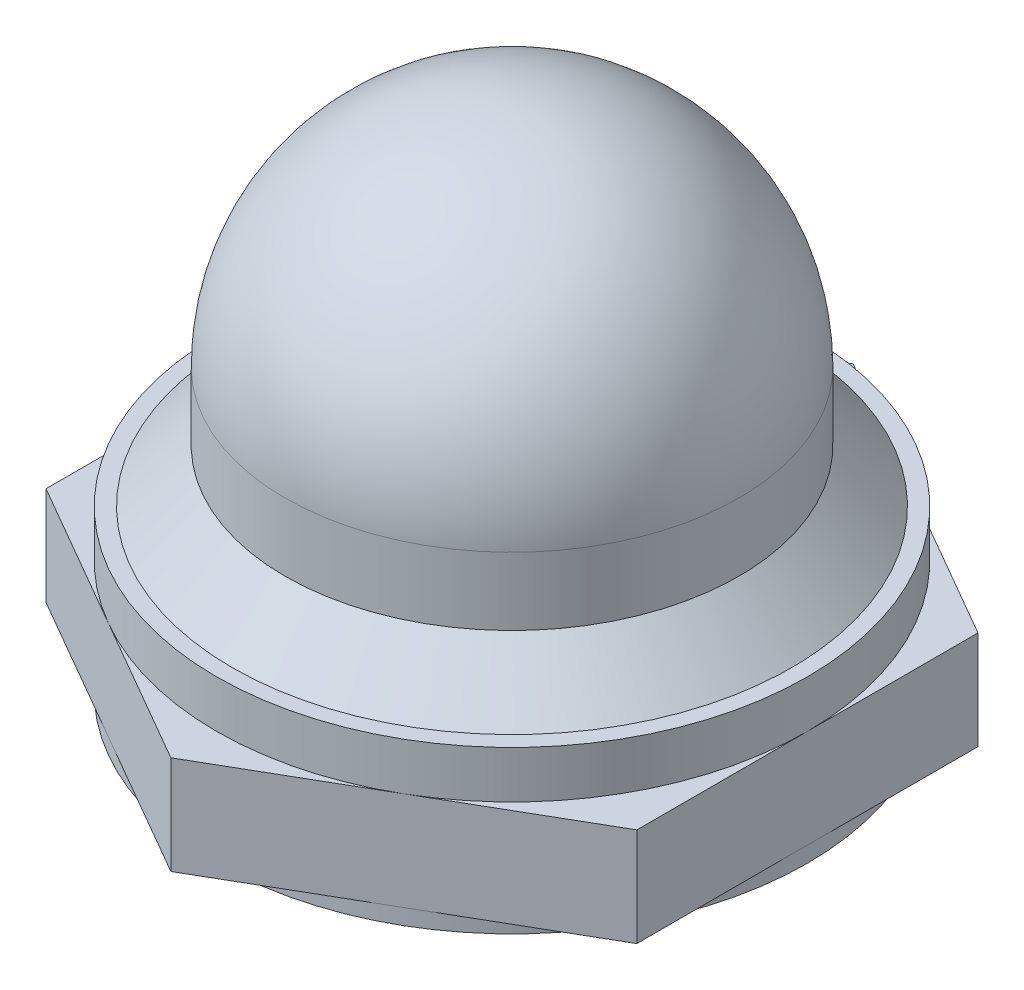
ISO-10303-21;
HEADER;
FILE_DESCRIPTION(('STEP AP214'),'2;1');
FILE_NAME('part.step','',(''),(''),'','','');
FILE_SCHEMA(('AUTOMOTIVE_DESIGN { 1 0 10303 214 1 1 1 1 }'));
ENDSEC;
DATA;
#1=APPLICATION_CONTEXT('core data for automotive mechanical design processes');
#2=APPLICATION_PROTOCOL_DEFINITION('international standard','automotive_design',2000,#1);
#3=PRODUCT_CONTEXT('',#1,'mechanical');
#4=PRODUCT('Part','Part','',(#3));
#5=PRODUCT_RELATED_PRODUCT_CATEGORY('part','',(#4));
#6=PRODUCT_DEFINITION_FORMATION('','',#4);
#7=PRODUCT_DEFINITION_CONTEXT('part definition',#1,'design');
#8=PRODUCT_DEFINITION('design','',#6,#7);
#9=PRODUCT_DEFINITION_SHAPE('','',#8);
#10=(LENGTH_UNIT() NAMED_UNIT(*) SI_UNIT(.MILLI.,.METRE.));
#11=(NAMED_UNIT(*) PLANE_ANGLE_UNIT() SI_UNIT($,.RADIAN.));
#12=(NAMED_UNIT(*) SI_UNIT($,.STERADIAN.) SOLID_ANGLE_UNIT());
#13=UNCERTAINTY_MEASURE_WITH_UNIT(LENGTH_MEASURE(1.E-05),#10,'distance_accuracy_value','');
#14=(GEOMETRIC_REPRESENTATION_CONTEXT(3) GLOBAL_UNCERTAINTY_ASSIGNED_CONTEXT((#13)) GLOBAL_UNIT_ASSIGNED_CONTEXT((#10,
#11,#12)) REPRESENTATION_CONTEXT('',''));
#15=CARTESIAN_POINT('',(0.,0.,0.));
#16=DIRECTION('',(0.,0.,1.));
#17=DIRECTION('',(1.,0.,0.));
#18=AXIS2_PLACEMENT_3D('',#15,#16,#17);
#19=CARTESIAN_POINT('',(0.,0.,0.));
#20=DIRECTION('',(0.,1.,0.));
#21=DIRECTION('',(0.,0.,1.));
#22=AXIS2_PLACEMENT_3D('',#19,#20,#21);
#23=PLANE('',#22);
#24=CARTESIAN_POINT('',(0.,0.,0.));
#25=DIRECTION('',(0.,-1.,0.));
#26=DIRECTION('',(0.,0.,-1.));
#27=AXIS2_PLACEMENT_3D('',#24,#25,#26);
#28=CIRCLE('',#27,4.7625);
#29=CARTESIAN_POINT('',(2.38125,0.,-4.12444598552339));
#30=VERTEX_POINT('',#29);
#31=CARTESIAN_POINT('',(4.7625,0.,0.));
#32=VERTEX_POINT('',#31);
#33=EDGE_CURVE('E59',#30,#32,#28,.T.);
#34=ORIENTED_EDGE('',*,*,#33,.F.);
#35=DIRECTION('',(-0.866025403784439,0.,-0.5));
#36=VECTOR('',#35,1.);
#37=CARTESIAN_POINT('',(4.7625,0.,-2.74963065701561));
#38=LINE('',#37,#36);
#39=CARTESIAN_POINT('',(4.7625,0.,-2.74963065701561));
#40=VERTEX_POINT('',#39);
#41=EDGE_CURVE('E143',#40,#30,#38,.T.);
#42=ORIENTED_EDGE('',*,*,#41,.F.);
#43=DIRECTION('',(0.,0.,-1.));
#44=VECTOR('',#43,1.);
#45=CARTESIAN_POINT('',(4.76250000000003,0.,2.74963065701561));
#46=LINE('',#45,#44);
#47=EDGE_CURVE('E160',#32,#40,#46,.T.);
#48=ORIENTED_EDGE('',*,*,#47,.F.);
#49=EDGE_LOOP('',(#34,#42,#48));
#50=FACE_BOUND('',#49,.T.);
#51=ADVANCED_FACE('F48',(#50),#23,.F.);
#52=CARTESIAN_POINT('',(2.38125,0.,4.12444598552336));
#53=VERTEX_POINT('',#52);
#54=EDGE_CURVE('E13',#32,#53,#28,.T.);
#55=ORIENTED_EDGE('',*,*,#54,.F.);
#56=CARTESIAN_POINT('',(4.76250000000003,0.,2.74963065701561));
#57=VERTEX_POINT('',#56);
#58=EDGE_CURVE('E158',#57,#32,#46,.T.);
#59=ORIENTED_EDGE('',*,*,#58,.F.);
#60=DIRECTION('',(0.866025403784439,0.,-0.5));
#61=VECTOR('',#60,1.);
#62=CARTESIAN_POINT('',(0.,0.,5.49926131403117));
#63=LINE('',#62,#61);
#64=EDGE_CURVE('E228',#53,#57,#63,.T.);
#65=ORIENTED_EDGE('',*,*,#64,.F.);
#66=EDGE_LOOP('',(#55,#59,#65));
#67=FACE_BOUND('',#66,.T.);
#68=ADVANCED_FACE('F294',(#67),#23,.F.);
#69=CARTESIAN_POINT('',(-2.38125,0.,4.12444598552336));
#70=VERTEX_POINT('',#69);
#71=EDGE_CURVE('E57',#53,#70,#28,.T.);
#72=ORIENTED_EDGE('',*,*,#71,.F.);
#73=CARTESIAN_POINT('',(0.,0.,5.49926131403117));
#74=VERTEX_POINT('',#73);
#75=EDGE_CURVE('E229',#74,#53,#63,.T.);
#76=ORIENTED_EDGE('',*,*,#75,.F.);
#77=DIRECTION('',(0.866025403784439,0.,0.5));
#78=VECTOR('',#77,1.);
#79=CARTESIAN_POINT('',(-4.76249999999995,0.,2.74963065701561));
#80=LINE('',#79,#78);
#81=EDGE_CURVE('E224',#70,#74,#80,.T.);
#82=ORIENTED_EDGE('',*,*,#81,.F.);
#83=EDGE_LOOP('',(#72,#76,#82));
#84=FACE_BOUND('',#83,.T.);
#85=ADVANCED_FACE('F278',(#84),#23,.F.);
#86=CARTESIAN_POINT('',(-4.76250000000002,0.,0.));
#87=VERTEX_POINT('',#86);
#88=EDGE_CURVE('E169',#70,#87,#28,.T.);
#89=ORIENTED_EDGE('',*,*,#88,.F.);
#90=CARTESIAN_POINT('',(-4.76249999999995,0.,2.74963065701561));
#91=VERTEX_POINT('',#90);
#92=EDGE_CURVE('E225',#91,#70,#80,.T.);
#93=ORIENTED_EDGE('',*,*,#92,.F.);
#94=DIRECTION('',(0.,0.,1.));
#95=VECTOR('',#94,1.);
#96=CARTESIAN_POINT('',(-4.7625,0.,-2.74963065701561));
#97=LINE('',#96,#95);
#98=EDGE_CURVE('E220',#87,#91,#97,.T.);
#99=ORIENTED_EDGE('',*,*,#98,.F.);
#100=EDGE_LOOP('',(#89,#93,#99));
#101=FACE_BOUND('',#100,.T.);
#102=ADVANCED_FACE('F274',(#101),#23,.F.);
#103=CARTESIAN_POINT('',(-2.38125,0.,-4.12444598552342));
#104=VERTEX_POINT('',#103);
#105=EDGE_CURVE('E73',#87,#104,#28,.T.);
#106=ORIENTED_EDGE('',*,*,#105,.F.);
#107=CARTESIAN_POINT('',(-4.7625,0.,-2.74963065701561));
#108=VERTEX_POINT('',#107);
#109=EDGE_CURVE('E221',#108,#87,#97,.T.);
#110=ORIENTED_EDGE('',*,*,#109,.F.);
#111=DIRECTION('',(-0.866025403784439,0.,0.5));
#112=VECTOR('',#111,1.);
#113=CARTESIAN_POINT('',(0.,0.,-5.49926131403117));
#114=LINE('',#113,#112);
#115=EDGE_CURVE('E153',#104,#108,#114,.T.);
#116=ORIENTED_EDGE('',*,*,#115,.F.);
#117=EDGE_LOOP('',(#106,#110,#116));
#118=FACE_BOUND('',#117,.T.);
#119=ADVANCED_FACE('F305',(#118),#23,.F.);
#120=CARTESIAN_POINT('',(0.,1.58749999999999,0.));
#121=DIRECTION('',(0.,1.,0.));
#122=DIRECTION('',(0.,0.,1.));
#123=AXIS2_PLACEMENT_3D('',#120,#121,#122);
#124=PLANE('',#123);
#125=DIRECTION('',(-0.866025403784439,0.,-0.5));
#126=VECTOR('',#125,1.);
#127=CARTESIAN_POINT('',(4.7625,1.58749999999999,-2.74963065701561));
#128=LINE('',#127,#126);
#129=CARTESIAN_POINT('',(4.7625,1.58749999999999,-2.74963065701561));
#130=VERTEX_POINT('',#129);
#131=CARTESIAN_POINT('',(2.38125,1.58749999999999,-4.12444598552339));
#132=VERTEX_POINT('',#131);
#133=EDGE_CURVE('E198',#130,#132,#128,.T.);
#134=ORIENTED_EDGE('',*,*,#133,.T.);
#135=CARTESIAN_POINT('',(0.,1.58749999999999,0.));
#136=DIRECTION('',(0.,-1.,0.));
#137=DIRECTION('',(0.,0.,-1.));
#138=AXIS2_PLACEMENT_3D('',#135,#136,#137);
#139=CIRCLE('',#138,4.7625);
#140=CARTESIAN_POINT('',(4.7625,1.58749999999999,0.));
#141=VERTEX_POINT('',#140);
#142=EDGE_CURVE('E173',#132,#141,#139,.T.);
#143=ORIENTED_EDGE('',*,*,#142,.T.);
#144=DIRECTION('',(0.,0.,-1.));
#145=VECTOR('',#144,1.);
#146=CARTESIAN_POINT('',(4.76250000000003,1.58749999999999,2.74963065701561));
#147=LINE('',#146,#145);
#148=EDGE_CURVE('E197',#141,#130,#147,.T.);
#149=ORIENTED_EDGE('',*,*,#148,.T.);
#150=EDGE_LOOP('',(#134,#143,#149));
#151=FACE_BOUND('',#150,.T.);
#152=ADVANCED_FACE('F290',(#151),#124,.T.);
#153=CARTESIAN_POINT('',(4.76250000000003,1.58749999999999,2.74963065701561));
#154=VERTEX_POINT('',#153);
#155=EDGE_CURVE('E193',#154,#141,#147,.T.);
#156=ORIENTED_EDGE('',*,*,#155,.T.);
#157=CARTESIAN_POINT('',(2.38125,1.58749999999999,4.12444598552336));
#158=VERTEX_POINT('',#157);
#159=EDGE_CURVE('E168',#141,#158,#139,.T.);
#160=ORIENTED_EDGE('',*,*,#159,.T.);
#161=DIRECTION('',(0.866025403784439,0.,-0.5));
#162=VECTOR('',#161,1.);
#163=CARTESIAN_POINT('',(0.,1.58749999999999,5.49926131403117));
#164=LINE('',#163,#162);
#165=EDGE_CURVE('E213',#158,#154,#164,.T.);
#166=ORIENTED_EDGE('',*,*,#165,.T.);
#167=EDGE_LOOP('',(#156,#160,#166));
#168=FACE_BOUND('',#167,.T.);
#169=ADVANCED_FACE('F286',(#168),#124,.T.);
#170=CARTESIAN_POINT('',(0.,1.58749999999999,5.49926131403117));
#171=VERTEX_POINT('',#170);
#172=EDGE_CURVE('E214',#171,#158,#164,.T.);
#173=ORIENTED_EDGE('',*,*,#172,.T.);
#174=CARTESIAN_POINT('',(-2.38125,1.58749999999999,4.12444598552336));
#175=VERTEX_POINT('',#174);
#176=EDGE_CURVE('E171',#158,#175,#139,.T.);
#177=ORIENTED_EDGE('',*,*,#176,.T.);
#178=DIRECTION('',(0.866025403784439,0.,0.5));
#179=VECTOR('',#178,1.);
#180=CARTESIAN_POINT('',(-4.76249999999995,1.58749999999999,2.74963065701561));
#181=LINE('',#180,#179);
#182=EDGE_CURVE('E209',#175,#171,#181,.T.);
#183=ORIENTED_EDGE('',*,*,#182,.T.);
#184=EDGE_LOOP('',(#173,#177,#183));
#185=FACE_BOUND('',#184,.T.);
#186=ADVANCED_FACE('F259',(#185),#124,.T.);
#187=CARTESIAN_POINT('',(-4.76249999999995,1.58749999999999,2.74963065701561));
#188=VERTEX_POINT('',#187);
#189=EDGE_CURVE('E210',#188,#175,#181,.T.);
#190=ORIENTED_EDGE('',*,*,#189,.T.);
#191=CARTESIAN_POINT('',(-4.76250000000002,1.58749999999999,0.));
#192=VERTEX_POINT('',#191);
#193=EDGE_CURVE('E250',#175,#192,#139,.T.);
#194=ORIENTED_EDGE('',*,*,#193,.T.);
#195=DIRECTION('',(0.,0.,1.));
#196=VECTOR('',#195,1.);
#197=CARTESIAN_POINT('',(-4.7625,1.58749999999999,-2.74963065701561));
#198=LINE('',#197,#196);
#199=EDGE_CURVE('E205',#192,#188,#198,.T.);
#200=ORIENTED_EDGE('',*,*,#199,.T.);
#201=EDGE_LOOP('',(#190,#194,#200));
#202=FACE_BOUND('',#201,.T.);
#203=ADVANCED_FACE('F266',(#202),#124,.T.);
#204=CARTESIAN_POINT('',(-4.7625,1.58749999999999,-2.74963065701561));
#205=VERTEX_POINT('',#204);
#206=EDGE_CURVE('E206',#205,#192,#198,.T.);
#207=ORIENTED_EDGE('',*,*,#206,.T.);
#208=CARTESIAN_POINT('',(-2.38125,1.58749999999999,-4.12444598552342));
#209=VERTEX_POINT('',#208);
#210=EDGE_CURVE('E246',#192,#209,#139,.T.);
#211=ORIENTED_EDGE('',*,*,#210,.T.);
#212=DIRECTION('',(-0.866025403784439,0.,0.5));
#213=VECTOR('',#212,1.);
#214=CARTESIAN_POINT('',(0.,1.58749999999999,-5.49926131403117));
#215=LINE('',#214,#213);
#216=EDGE_CURVE('E201',#209,#205,#215,.T.);
#217=ORIENTED_EDGE('',*,*,#216,.T.);
#218=EDGE_LOOP('',(#207,#211,#217));
#219=FACE_BOUND('',#218,.T.);
#220=ADVANCED_FACE('F332',(#219),#124,.T.);
#221=CARTESIAN_POINT('',(0.,1.58749999999999,-5.49926131403117));
#222=VERTEX_POINT('',#221);
#223=EDGE_CURVE('E202',#222,#209,#215,.T.);
#224=ORIENTED_EDGE('',*,*,#223,.T.);
#225=EDGE_CURVE('E190',#209,#132,#139,.T.);
#226=ORIENTED_EDGE('',*,*,#225,.T.);
#227=EDGE_CURVE('E196',#132,#222,#128,.T.);
#228=ORIENTED_EDGE('',*,*,#227,.T.);
#229=EDGE_LOOP('',(#224,#226,#228));
#230=FACE_BOUND('',#229,.T.);
#231=ADVANCED_FACE('F304',(#230),#124,.T.);
#232=EDGE_CURVE('E66',#104,#30,#28,.T.);
#233=ORIENTED_EDGE('',*,*,#232,.F.);
#234=CARTESIAN_POINT('',(0.,0.,-5.49926131403117));
#235=VERTEX_POINT('',#234);
#236=EDGE_CURVE('E157',#235,#104,#114,.T.);
#237=ORIENTED_EDGE('',*,*,#236,.F.);
#238=EDGE_CURVE('E146',#30,#235,#38,.T.);
#239=ORIENTED_EDGE('',*,*,#238,.F.);
#240=EDGE_LOOP('',(#233,#237,#239));
#241=FACE_BOUND('',#240,.T.);
#242=ADVANCED_FACE('F155',(#241),#23,.F.);
#243=CARTESIAN_POINT('',(4.76250000000003,1.58749999999999,2.74963065701561));
#244=DIRECTION('',(-1.,0.,0.));
#245=DIRECTION('',(0.,0.,1.));
#246=AXIS2_PLACEMENT_3D('',#243,#244,#245);
#247=PLANE('',#246);
#248=ORIENTED_EDGE('',*,*,#58,.T.);
#249=ORIENTED_EDGE('',*,*,#47,.T.);
#250=DIRECTION('',(0.,-1.,0.));
#251=VECTOR('',#250,1.);
#252=CARTESIAN_POINT('',(4.7625,1.58749999999999,-2.74963065701561));
#253=LINE('',#252,#251);
#254=EDGE_CURVE('E52',#130,#40,#253,.T.);
#255=ORIENTED_EDGE('',*,*,#254,.F.);
#256=ORIENTED_EDGE('',*,*,#148,.F.);
#257=ORIENTED_EDGE('',*,*,#155,.F.);
#258=DIRECTION('',(0.,-1.,0.));
#259=VECTOR('',#258,1.);
#260=CARTESIAN_POINT('',(4.76250000000003,1.58749999999999,2.74963065701561));
#261=LINE('',#260,#259);
#262=EDGE_CURVE('E217',#154,#57,#261,.T.);
#263=ORIENTED_EDGE('',*,*,#262,.T.);
#264=EDGE_LOOP('',(#248,#249,#255,#256,#257,#263));
#265=FACE_BOUND('',#264,.T.);
#266=ADVANCED_FACE('F50',(#265),#247,.F.);
#267=CARTESIAN_POINT('',(4.7625,1.58749999999999,-2.74963065701561));
#268=DIRECTION('',(-0.5,0.,0.866025403784439));
#269=DIRECTION('',(0.866025403784439,0.,0.5));
#270=AXIS2_PLACEMENT_3D('',#267,#268,#269);
#271=PLANE('',#270);
#272=ORIENTED_EDGE('',*,*,#41,.T.);
#273=ORIENTED_EDGE('',*,*,#238,.T.);
#274=DIRECTION('',(0.,-1.,0.));
#275=VECTOR('',#274,1.);
#276=CARTESIAN_POINT('',(0.,1.58749999999999,-5.49926131403117));
#277=LINE('',#276,#275);
#278=EDGE_CURVE('E242',#222,#235,#277,.T.);
#279=ORIENTED_EDGE('',*,*,#278,.F.);
#280=ORIENTED_EDGE('',*,*,#227,.F.);
#281=ORIENTED_EDGE('',*,*,#133,.F.);
#282=ORIENTED_EDGE('',*,*,#254,.T.);
#283=EDGE_LOOP('',(#272,#273,#279,#280,#281,#282));
#284=FACE_BOUND('',#283,.T.);
#285=ADVANCED_FACE('F144',(#284),#271,.F.);
#286=CARTESIAN_POINT('',(0.,1.58749999999999,-5.49926131403117));
#287=DIRECTION('',(0.5,0.,0.866025403784439));
#288=DIRECTION('',(0.866025403784439,0.,-0.5));
#289=AXIS2_PLACEMENT_3D('',#286,#287,#288);
#290=PLANE('',#289);
#291=ORIENTED_EDGE('',*,*,#236,.T.);
#292=ORIENTED_EDGE('',*,*,#115,.T.);
#293=DIRECTION('',(0.,-1.,0.));
#294=VECTOR('',#293,1.);
#295=CARTESIAN_POINT('',(-4.7625,1.58749999999999,-2.74963065701561));
#296=LINE('',#295,#294);
#297=EDGE_CURVE('E240',#205,#108,#296,.T.);
#298=ORIENTED_EDGE('',*,*,#297,.F.);
#299=ORIENTED_EDGE('',*,*,#216,.F.);
#300=ORIENTED_EDGE('',*,*,#223,.F.);
#301=ORIENTED_EDGE('',*,*,#278,.T.);
#302=EDGE_LOOP('',(#291,#292,#298,#299,#300,#301));
#303=FACE_BOUND('',#302,.T.);
#304=ADVANCED_FACE('F314',(#303),#290,.F.);
#305=CARTESIAN_POINT('',(-4.7625,1.58749999999999,-2.74963065701561));
#306=DIRECTION('',(1.,0.,0.));
#307=DIRECTION('',(0.,0.,-1.));
#308=AXIS2_PLACEMENT_3D('',#305,#306,#307);
#309=PLANE('',#308);
#310=ORIENTED_EDGE('',*,*,#109,.T.);
#311=ORIENTED_EDGE('',*,*,#98,.T.);
#312=DIRECTION('',(0.,-1.,0.));
#313=VECTOR('',#312,1.);
#314=CARTESIAN_POINT('',(-4.76249999999995,1.58749999999999,2.74963065701561));
#315=LINE('',#314,#313);
#316=EDGE_CURVE('E237',#188,#91,#315,.T.);
#317=ORIENTED_EDGE('',*,*,#316,.F.);
#318=ORIENTED_EDGE('',*,*,#199,.F.);
#319=ORIENTED_EDGE('',*,*,#206,.F.);
#320=ORIENTED_EDGE('',*,*,#297,.T.);
#321=EDGE_LOOP('',(#310,#311,#317,#318,#319,#320));
#322=FACE_BOUND('',#321,.T.);
#323=ADVANCED_FACE('F270',(#322),#309,.F.);
#324=CARTESIAN_POINT('',(-4.76249999999995,1.58749999999999,2.74963065701561));
#325=DIRECTION('',(0.5,0.,-0.866025403784438));
#326=DIRECTION('',(-0.866025403784439,0.,-0.5));
#327=AXIS2_PLACEMENT_3D('',#324,#325,#326);
#328=PLANE('',#327);
#329=ORIENTED_EDGE('',*,*,#92,.T.);
#330=ORIENTED_EDGE('',*,*,#81,.T.);
#331=DIRECTION('',(0.,-1.,0.));
#332=VECTOR('',#331,1.);
#333=CARTESIAN_POINT('',(0.,1.58749999999999,5.49926131403117));
#334=LINE('',#333,#332);
#335=EDGE_CURVE('E234',#171,#74,#334,.T.);
#336=ORIENTED_EDGE('',*,*,#335,.F.);
#337=ORIENTED_EDGE('',*,*,#182,.F.);
#338=ORIENTED_EDGE('',*,*,#189,.F.);
#339=ORIENTED_EDGE('',*,*,#316,.T.);
#340=EDGE_LOOP('',(#329,#330,#336,#337,#338,#339));
#341=FACE_BOUND('',#340,.T.);
#342=ADVANCED_FACE('F265',(#341),#328,.F.);
#343=CARTESIAN_POINT('',(0.,1.58749999999999,5.49926131403117));
#344=DIRECTION('',(-0.5,0.,-0.866025403784439));
#345=DIRECTION('',(-0.866025403784439,0.,0.5));
#346=AXIS2_PLACEMENT_3D('',#343,#344,#345);
#347=PLANE('',#346);
#348=ORIENTED_EDGE('',*,*,#75,.T.);
#349=ORIENTED_EDGE('',*,*,#64,.T.);
#350=ORIENTED_EDGE('',*,*,#262,.F.);
#351=ORIENTED_EDGE('',*,*,#165,.F.);
#352=ORIENTED_EDGE('',*,*,#172,.F.);
#353=ORIENTED_EDGE('',*,*,#335,.T.);
#354=EDGE_LOOP('',(#348,#349,#350,#351,#352,#353));
#355=FACE_BOUND('',#354,.T.);
#356=ADVANCED_FACE('F281',(#355),#347,.F.);
#357=CARTESIAN_POINT('',(0.,0.,0.));
#358=DIRECTION('',(0.,-1.,0.));
#359=DIRECTION('',(0.,0.,-1.));
#360=AXIS2_PLACEMENT_3D('',#357,#358,#359);
#361=CYLINDRICAL_SURFACE('',#360,3.6576);
#362=CARTESIAN_POINT('',(0.,4.29260000000001,0.));
#363=DIRECTION('',(0.,-1.,0.));
#364=DIRECTION('',(0.,0.,-1.));
#365=AXIS2_PLACEMENT_3D('',#362,#363,#364);
#366=CIRCLE('',#365,3.6576);
#367=CARTESIAN_POINT('',(0.,4.29260000000001,-3.6576));
#368=VERTEX_POINT('',#367);
#369=EDGE_CURVE('E163',#368,#368,#366,.T.);
#370=ORIENTED_EDGE('',*,*,#369,.T.);
#371=EDGE_LOOP('',(#370));
#372=FACE_BOUND('',#371,.T.);
#373=CARTESIAN_POINT('',(0.,3.20040000000002,0.));
#374=DIRECTION('',(0.,-1.,0.));
#375=DIRECTION('',(0.,0.,-1.));
#376=AXIS2_PLACEMENT_3D('',#373,#374,#375);
#377=CIRCLE('',#376,3.6576);
#378=CARTESIAN_POINT('',(0.,3.20040000000002,-3.6576));
#379=VERTEX_POINT('',#378);
#380=EDGE_CURVE('E179',#379,#379,#377,.T.);
#381=ORIENTED_EDGE('',*,*,#380,.F.);
#382=EDGE_LOOP('',(#381));
#383=FACE_BOUND('',#382,.T.);
#384=ADVANCED_FACE('F309',(#372,#383),#361,.T.);
#385=CARTESIAN_POINT('',(0.,2.3495,0.));
#386=DIRECTION('',(0.,-1.,0.));
#387=DIRECTION('',(0.,0.,-1.));
#388=AXIS2_PLACEMENT_3D('',#385,#386,#387);
#389=CONICAL_SURFACE('',#388,4.5085,0.785398163397443);
#390=ORIENTED_EDGE('',*,*,#380,.T.);
#391=EDGE_LOOP('',(#390));
#392=FACE_BOUND('',#391,.T.);
#393=CARTESIAN_POINT('',(0.,2.3495,0.));
#394=DIRECTION('',(0.,-1.,0.));
#395=DIRECTION('',(0.,0.,-1.));
#396=AXIS2_PLACEMENT_3D('',#393,#394,#395);
#397=CIRCLE('',#396,4.5085);
#398=CARTESIAN_POINT('',(0.,2.3495,-4.5085));
#399=VERTEX_POINT('',#398);
#400=EDGE_CURVE('E182',#399,#399,#397,.T.);
#401=ORIENTED_EDGE('',*,*,#400,.F.);
#402=EDGE_LOOP('',(#401));
#403=FACE_BOUND('',#402,.T.);
#404=ADVANCED_FACE('F385',(#392,#403),#389,.T.);
#405=CARTESIAN_POINT('',(0.,2.3495,-4.50850000000003));
#406=DIRECTION('',(0.,1.,0.));
#407=DIRECTION('',(0.,0.,1.));
#408=AXIS2_PLACEMENT_3D('',#405,#406,#407);
#409=PLANE('',#408);
#410=ORIENTED_EDGE('',*,*,#400,.T.);
#411=EDGE_LOOP('',(#410));
#412=FACE_BOUND('',#411,.T.);
#413=CARTESIAN_POINT('',(0.,2.3495,0.));
#414=DIRECTION('',(0.,-1.,0.));
#415=DIRECTION('',(0.,0.,-1.));
#416=AXIS2_PLACEMENT_3D('',#413,#414,#415);
#417=CIRCLE('',#416,4.7625);
#418=CARTESIAN_POINT('',(0.,2.3495,-4.7625));
#419=VERTEX_POINT('',#418);
#420=EDGE_CURVE('E185',#419,#419,#417,.T.);
#421=ORIENTED_EDGE('',*,*,#420,.F.);
#422=EDGE_LOOP('',(#421));
#423=FACE_BOUND('',#422,.T.);
#424=ADVANCED_FACE('F393',(#412,#423),#409,.T.);
#425=CARTESIAN_POINT('',(0.,0.,0.));
#426=DIRECTION('',(0.,-1.,0.));
#427=DIRECTION('',(0.,0.,-1.));
#428=AXIS2_PLACEMENT_3D('',#425,#426,#427);
#429=CYLINDRICAL_SURFACE('',#428,4.7625);
#430=ORIENTED_EDGE('',*,*,#420,.T.);
#431=EDGE_LOOP('',(#430));
#432=FACE_BOUND('',#431,.T.);
#433=ORIENTED_EDGE('',*,*,#142,.F.);
#434=ORIENTED_EDGE('',*,*,#225,.F.);
#435=ORIENTED_EDGE('',*,*,#210,.F.);
#436=ORIENTED_EDGE('',*,*,#193,.F.);
#437=ORIENTED_EDGE('',*,*,#176,.F.);
#438=ORIENTED_EDGE('',*,*,#159,.F.);
#439=EDGE_LOOP('',(#433,#434,#435,#436,#437,#438));
#440=FACE_BOUND('',#439,.T.);
#441=ADVANCED_FACE('F287',(#432,#440),#429,.T.);
#442=CARTESIAN_POINT('',(0.,4.29260000000001,0.));
#443=DIRECTION('',(0.,-1.,0.));
#444=DIRECTION('',(0.,0.,-1.));
#445=AXIS2_PLACEMENT_3D('',#442,#443,#444);
#446=SPHERICAL_SURFACE('',#445,3.6576);
#447=ORIENTED_EDGE('',*,*,#369,.F.);
#448=EDGE_LOOP('',(#447));
#449=FACE_BOUND('',#448,.T.);
#450=ADVANCED_FACE('F408',(#449),#446,.T.);
#451=CARTESIAN_POINT('',(0.,0.,0.));
#452=DIRECTION('',(0.,-1.,0.));
#453=DIRECTION('',(0.,0.,-1.));
#454=AXIS2_PLACEMENT_3D('',#451,#452,#453);
#455=CYLINDRICAL_SURFACE('',#454,4.7625);
#456=ORIENTED_EDGE('',*,*,#33,.T.);
#457=ORIENTED_EDGE('',*,*,#54,.T.);
#458=ORIENTED_EDGE('',*,*,#71,.T.);
#459=ORIENTED_EDGE('',*,*,#88,.T.);
#460=ORIENTED_EDGE('',*,*,#105,.T.);
#461=ORIENTED_EDGE('',*,*,#232,.T.);
#462=EDGE_LOOP('',(#456,#457,#458,#459,#460,#461));
#463=FACE_BOUND('',#462,.T.);
#464=CARTESIAN_POINT('',(0.,-0.254000000000004,0.));
#465=DIRECTION('',(0.,-1.,0.));
#466=DIRECTION('',(0.,0.,-1.));
#467=AXIS2_PLACEMENT_3D('',#464,#465,#466);
#468=CIRCLE('',#467,4.7625);
#469=CARTESIAN_POINT('',(0.,-0.254000000000004,-4.7625));
#470=VERTEX_POINT('',#469);
#471=EDGE_CURVE('E164',#470,#470,#468,.T.);
#472=ORIENTED_EDGE('',*,*,#471,.F.);
#473=EDGE_LOOP('',(#472));
#474=FACE_BOUND('',#473,.T.);
#475=ADVANCED_FACE('F165',(#463,#474),#455,.T.);
#476=CARTESIAN_POINT('',(0.,-0.254000000000004,-4.7625));
#477=DIRECTION('',(0.,-1.,0.));
#478=DIRECTION('',(0.,0.,-1.));
#479=AXIS2_PLACEMENT_3D('',#476,#477,#478);
#480=PLANE('',#479);
#481=ORIENTED_EDGE('',*,*,#471,.T.);
#482=EDGE_LOOP('',(#481));
#483=FACE_BOUND('',#482,.T.);
#484=CARTESIAN_POINT('',(0.,-0.254000000000004,0.));
#485=DIRECTION('',(0.,-1.,0.));
#486=DIRECTION('',(0.,0.,-1.));
#487=AXIS2_PLACEMENT_3D('',#484,#485,#486);
#488=CIRCLE('',#487,3.175);
#489=CARTESIAN_POINT('',(0.,-0.254000000000004,-3.175));
#490=VERTEX_POINT('',#489);
#491=EDGE_CURVE('E474',#490,#490,#488,.T.);
#492=ORIENTED_EDGE('',*,*,#491,.F.);
#493=EDGE_LOOP('',(#492));
#494=FACE_BOUND('',#493,.T.);
#495=ADVANCED_FACE('F423',(#483,#494),#480,.T.);
#496=CARTESIAN_POINT('',(0.,4.29260000000001,0.));
#497=DIRECTION('',(0.,-1.,0.));
#498=DIRECTION('',(0.,0.,-1.));
#499=AXIS2_PLACEMENT_3D('',#496,#497,#498);
#500=SPHERICAL_SURFACE('',#499,3.175);
#501=CARTESIAN_POINT('',(0.,4.29260000000001,0.));
#502=DIRECTION('',(0.,-1.,0.));
#503=DIRECTION('',(0.,0.,-1.));
#504=AXIS2_PLACEMENT_3D('',#501,#502,#503);
#505=CIRCLE('',#504,3.175);
#506=CARTESIAN_POINT('',(0.,4.29260000000001,-3.175));
#507=VERTEX_POINT('',#506);
#508=EDGE_CURVE('E189',#507,#507,#505,.T.);
#509=ORIENTED_EDGE('',*,*,#508,.T.);
#510=EDGE_LOOP('',(#509));
#511=FACE_BOUND('',#510,.T.);
#512=ADVANCED_FACE('F430',(#511),#500,.F.);
#513=CARTESIAN_POINT('',(0.,1.58749999999999,0.));
#514=DIRECTION('',(0.,-1.,0.));
#515=DIRECTION('',(0.,0.,-1.));
#516=AXIS2_PLACEMENT_3D('',#513,#514,#515);
#517=CYLINDRICAL_SURFACE('',#516,3.175);
#518=ORIENTED_EDGE('',*,*,#508,.F.);
#519=EDGE_LOOP('',(#518));
#520=FACE_BOUND('',#519,.T.);
#521=ORIENTED_EDGE('',*,*,#491,.T.);
#522=EDGE_LOOP('',(#521));
#523=FACE_BOUND('',#522,.T.);
#524=ADVANCED_FACE('F438',(#520,#523),#517,.F.);
#525=CLOSED_SHELL('',(#51,#68,#85,#102,#119,#152,#169,#186,#203,#220,#231,#242,#266,#285,#304,
#323,#342,#356,#384,#404,#424,#441,#450,#475,#495,#512,#524));
#526=MANIFOLD_SOLID_BREP('B2',#525);
#527=ADVANCED_BREP_SHAPE_REPRESENTATION('',(#18,#526),#14);
#528=SHAPE_DEFINITION_REPRESENTATION(#9,#527);
ENDSEC;
END-ISO-10303-21;
